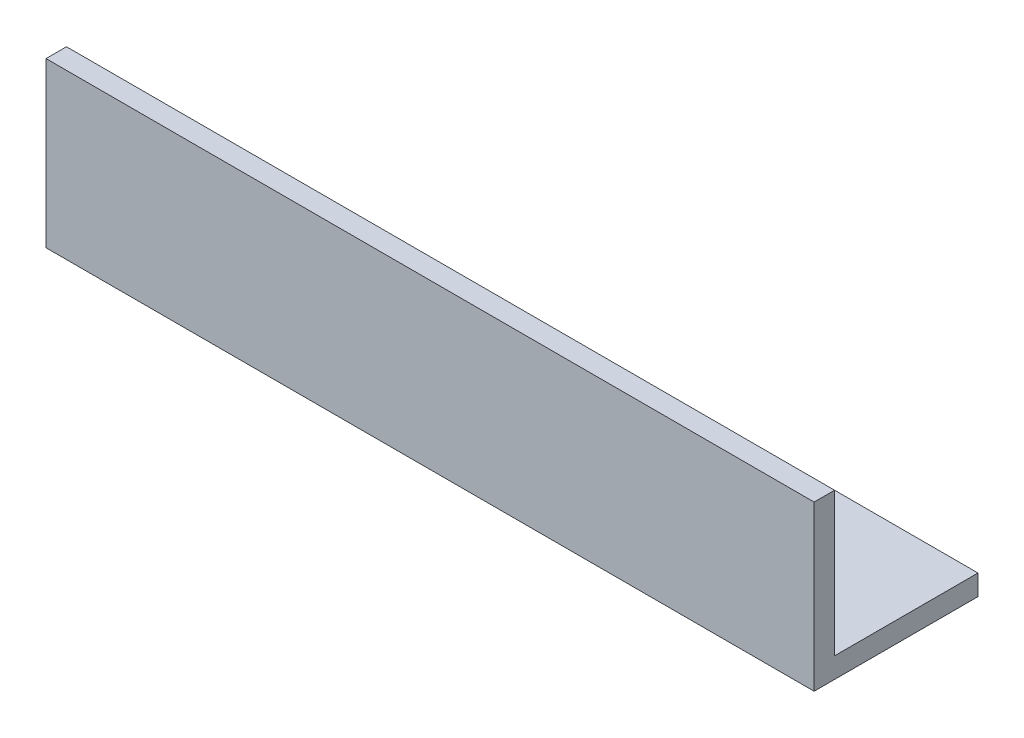
ISO-10303-21;
HEADER;
FILE_DESCRIPTION(('STEP AP214'),'2;1');
FILE_NAME('part.step','',(''),(''),'','','');
FILE_SCHEMA(('AUTOMOTIVE_DESIGN { 1 0 10303 214 1 1 1 1 }'));
ENDSEC;
DATA;
#1=APPLICATION_CONTEXT('core data for automotive mechanical design processes');
#2=APPLICATION_PROTOCOL_DEFINITION('international standard','automotive_design',2000,#1);
#3=PRODUCT_CONTEXT('',#1,'mechanical');
#4=PRODUCT('Part','Part','',(#3));
#5=PRODUCT_RELATED_PRODUCT_CATEGORY('part','',(#4));
#6=PRODUCT_DEFINITION_FORMATION('','',#4);
#7=PRODUCT_DEFINITION_CONTEXT('part definition',#1,'design');
#8=PRODUCT_DEFINITION('design','',#6,#7);
#9=PRODUCT_DEFINITION_SHAPE('','',#8);
#10=(LENGTH_UNIT() NAMED_UNIT(*) SI_UNIT(.MILLI.,.METRE.));
#11=(NAMED_UNIT(*) PLANE_ANGLE_UNIT() SI_UNIT($,.RADIAN.));
#12=(NAMED_UNIT(*) SI_UNIT($,.STERADIAN.) SOLID_ANGLE_UNIT());
#13=UNCERTAINTY_MEASURE_WITH_UNIT(LENGTH_MEASURE(1.E-05),#10,'distance_accuracy_value','');
#14=(GEOMETRIC_REPRESENTATION_CONTEXT(3) GLOBAL_UNCERTAINTY_ASSIGNED_CONTEXT((#13)) GLOBAL_UNIT_ASSIGNED_CONTEXT((#10,
#11,#12)) REPRESENTATION_CONTEXT('',''));
#15=CARTESIAN_POINT('',(0.,0.,0.));
#16=DIRECTION('',(0.,0.,1.));
#17=DIRECTION('',(1.,0.,0.));
#18=AXIS2_PLACEMENT_3D('',#15,#16,#17);
#19=CARTESIAN_POINT('',(150.,0.,0.));
#20=DIRECTION('',(0.,1.,0.));
#21=DIRECTION('',(0.,0.,1.));
#22=AXIS2_PLACEMENT_3D('',#19,#20,#21);
#23=PLANE('',#22);
#24=CARTESIAN_POINT('',(19.9999999999977,0.,-12.9999999999998));
#25=DIRECTION('',(0.,-1.,0.));
#26=DIRECTION('',(0.,0.,1.));
#27=AXIS2_PLACEMENT_3D('',#24,#25,#26);
#28=CIRCLE('',#27,4.99999999999999);
#29=CARTESIAN_POINT('',(19.9999999999977,0.,-7.9999999999998));
#30=VERTEX_POINT('',#29);
#31=EDGE_CURVE('E153',#30,#30,#28,.T.);
#32=ORIENTED_EDGE('',*,*,#31,.F.);
#33=EDGE_LOOP('',(#32));
#34=FACE_BOUND('',#33,.T.);
#35=CARTESIAN_POINT('',(49.9999999999977,0.,-13.));
#36=DIRECTION('',(0.,-1.,0.));
#37=DIRECTION('',(0.,0.,1.));
#38=AXIS2_PLACEMENT_3D('',#35,#36,#37);
#39=CIRCLE('',#38,4.99999999999999);
#40=CARTESIAN_POINT('',(49.9999999999977,0.,-8.00000000000001));
#41=VERTEX_POINT('',#40);
#42=EDGE_CURVE('E143',#41,#41,#39,.T.);
#43=ORIENTED_EDGE('',*,*,#42,.F.);
#44=EDGE_LOOP('',(#43));
#45=FACE_BOUND('',#44,.T.);
#46=CARTESIAN_POINT('',(100.,0.,-13.));
#47=DIRECTION('',(0.,-1.,0.));
#48=DIRECTION('',(0.,0.,-1.));
#49=AXIS2_PLACEMENT_3D('',#46,#47,#48);
#50=CIRCLE('',#49,4.99999999999999);
#51=CARTESIAN_POINT('',(100.,0.,-18.));
#52=VERTEX_POINT('',#51);
#53=EDGE_CURVE('E140',#52,#52,#50,.T.);
#54=ORIENTED_EDGE('',*,*,#53,.F.);
#55=EDGE_LOOP('',(#54));
#56=FACE_BOUND('',#55,.T.);
#57=CARTESIAN_POINT('',(130.,0.,-12.9999999999998));
#58=DIRECTION('',(0.,-1.,0.));
#59=DIRECTION('',(0.,0.,-1.));
#60=AXIS2_PLACEMENT_3D('',#57,#58,#59);
#61=CIRCLE('',#60,4.99999999999999);
#62=CARTESIAN_POINT('',(130.,0.,-17.9999999999998));
#63=VERTEX_POINT('',#62);
#64=EDGE_CURVE('E137',#63,#63,#61,.T.);
#65=ORIENTED_EDGE('',*,*,#64,.F.);
#66=EDGE_LOOP('',(#65));
#67=FACE_BOUND('',#66,.T.);
#68=DIRECTION('',(0.,0.,-1.));
#69=VECTOR('',#68,1.);
#70=CARTESIAN_POINT('',(0.,0.,0.));
#71=LINE('',#70,#69);
#72=CARTESIAN_POINT('',(0.,0.,0.));
#73=VERTEX_POINT('',#72);
#74=CARTESIAN_POINT('',(0.,0.,-32.));
#75=VERTEX_POINT('',#74);
#76=EDGE_CURVE('E117',#73,#75,#71,.T.);
#77=ORIENTED_EDGE('',*,*,#76,.T.);
#78=DIRECTION('',(-1.,0.,0.));
#79=VECTOR('',#78,1.);
#80=CARTESIAN_POINT('',(150.,0.,-32.));
#81=LINE('',#80,#79);
#82=CARTESIAN_POINT('',(150.,0.,-32.));
#83=VERTEX_POINT('',#82);
#84=EDGE_CURVE('E11',#83,#75,#81,.T.);
#85=ORIENTED_EDGE('',*,*,#84,.F.);
#86=DIRECTION('',(0.,0.,-1.));
#87=VECTOR('',#86,1.);
#88=CARTESIAN_POINT('',(150.,0.,0.));
#89=LINE('',#88,#87);
#90=CARTESIAN_POINT('',(150.,0.,0.));
#91=VERTEX_POINT('',#90);
#92=EDGE_CURVE('E82',#91,#83,#89,.T.);
#93=ORIENTED_EDGE('',*,*,#92,.F.);
#94=DIRECTION('',(-1.,0.,0.));
#95=VECTOR('',#94,1.);
#96=CARTESIAN_POINT('',(150.,0.,0.));
#97=LINE('',#96,#95);
#98=EDGE_CURVE('E113',#91,#73,#97,.T.);
#99=ORIENTED_EDGE('',*,*,#98,.T.);
#100=EDGE_LOOP('',(#77,#85,#93,#99));
#101=FACE_BOUND('',#100,.T.);
#102=ADVANCED_FACE('F34',(#34,#45,#56,#67,#101),#23,.F.);
#103=CARTESIAN_POINT('',(150.,4.,-32.));
#104=DIRECTION('',(0.,0.,-1.));
#105=DIRECTION('',(-1.,0.,0.));
#106=AXIS2_PLACEMENT_3D('',#103,#104,#105);
#107=PLANE('',#106);
#108=DIRECTION('',(0.,-1.,0.));
#109=VECTOR('',#108,1.);
#110=CARTESIAN_POINT('',(0.,4.,-32.));
#111=LINE('',#110,#109);
#112=CARTESIAN_POINT('',(0.,4.,-32.));
#113=VERTEX_POINT('',#112);
#114=EDGE_CURVE('E120',#113,#75,#111,.T.);
#115=ORIENTED_EDGE('',*,*,#114,.F.);
#116=DIRECTION('',(-1.,0.,0.));
#117=VECTOR('',#116,1.);
#118=CARTESIAN_POINT('',(150.,4.,-32.));
#119=LINE('',#118,#117);
#120=CARTESIAN_POINT('',(150.,4.,-32.));
#121=VERTEX_POINT('',#120);
#122=EDGE_CURVE('E43',#121,#113,#119,.T.);
#123=ORIENTED_EDGE('',*,*,#122,.F.);
#124=DIRECTION('',(0.,-1.,0.));
#125=VECTOR('',#124,1.);
#126=CARTESIAN_POINT('',(150.,4.,-32.));
#127=LINE('',#126,#125);
#128=EDGE_CURVE('E159',#121,#83,#127,.T.);
#129=ORIENTED_EDGE('',*,*,#128,.T.);
#130=ORIENTED_EDGE('',*,*,#84,.T.);
#131=EDGE_LOOP('',(#115,#123,#129,#130));
#132=FACE_BOUND('',#131,.T.);
#133=ADVANCED_FACE('F180',(#132),#107,.T.);
#134=CARTESIAN_POINT('',(150.,4.,0.));
#135=DIRECTION('',(0.,1.,0.));
#136=DIRECTION('',(0.,0.,1.));
#137=AXIS2_PLACEMENT_3D('',#134,#135,#136);
#138=PLANE('',#137);
#139=CARTESIAN_POINT('',(19.9999999999977,4.,-12.9999999999998));
#140=DIRECTION('',(0.,1.,0.));
#141=DIRECTION('',(0.,0.,1.));
#142=AXIS2_PLACEMENT_3D('',#139,#140,#141);
#143=CIRCLE('',#142,4.99999999999999);
#144=CARTESIAN_POINT('',(19.9999999999977,4.,-7.9999999999998));
#145=VERTEX_POINT('',#144);
#146=EDGE_CURVE('E37',#145,#145,#143,.T.);
#147=ORIENTED_EDGE('',*,*,#146,.F.);
#148=EDGE_LOOP('',(#147));
#149=FACE_BOUND('',#148,.T.);
#150=CARTESIAN_POINT('',(49.9999999999977,4.,-13.));
#151=DIRECTION('',(0.,1.,0.));
#152=DIRECTION('',(0.,0.,1.));
#153=AXIS2_PLACEMENT_3D('',#150,#151,#152);
#154=CIRCLE('',#153,4.99999999999999);
#155=CARTESIAN_POINT('',(49.9999999999977,4.,-8.00000000000001));
#156=VERTEX_POINT('',#155);
#157=EDGE_CURVE('E141',#156,#156,#154,.T.);
#158=ORIENTED_EDGE('',*,*,#157,.F.);
#159=EDGE_LOOP('',(#158));
#160=FACE_BOUND('',#159,.T.);
#161=CARTESIAN_POINT('',(100.,4.,-13.));
#162=DIRECTION('',(0.,1.,0.));
#163=DIRECTION('',(0.,0.,1.));
#164=AXIS2_PLACEMENT_3D('',#161,#162,#163);
#165=CIRCLE('',#164,4.99999999999999);
#166=CARTESIAN_POINT('',(100.,4.,-8.00000000000001));
#167=VERTEX_POINT('',#166);
#168=EDGE_CURVE('E138',#167,#167,#165,.T.);
#169=ORIENTED_EDGE('',*,*,#168,.F.);
#170=EDGE_LOOP('',(#169));
#171=FACE_BOUND('',#170,.T.);
#172=CARTESIAN_POINT('',(130.,4.,-12.9999999999998));
#173=DIRECTION('',(0.,1.,0.));
#174=DIRECTION('',(0.,0.,1.));
#175=AXIS2_PLACEMENT_3D('',#172,#173,#174);
#176=CIRCLE('',#175,4.99999999999999);
#177=CARTESIAN_POINT('',(130.,4.,-7.9999999999998));
#178=VERTEX_POINT('',#177);
#179=EDGE_CURVE('E121',#178,#178,#176,.T.);
#180=ORIENTED_EDGE('',*,*,#179,.F.);
#181=EDGE_LOOP('',(#180));
#182=FACE_BOUND('',#181,.T.);
#183=DIRECTION('',(0.,0.,-1.));
#184=VECTOR('',#183,1.);
#185=CARTESIAN_POINT('',(0.,4.,0.));
#186=LINE('',#185,#184);
#187=CARTESIAN_POINT('',(0.,4.,-4.));
#188=VERTEX_POINT('',#187);
#189=EDGE_CURVE('E124',#188,#113,#186,.T.);
#190=ORIENTED_EDGE('',*,*,#189,.F.);
#191=DIRECTION('',(-1.,0.,0.));
#192=VECTOR('',#191,1.);
#193=CARTESIAN_POINT('',(150.,4.,-4.));
#194=LINE('',#193,#192);
#195=CARTESIAN_POINT('',(150.,4.,-4.));
#196=VERTEX_POINT('',#195);
#197=EDGE_CURVE('E103',#196,#188,#194,.T.);
#198=ORIENTED_EDGE('',*,*,#197,.F.);
#199=DIRECTION('',(0.,0.,-1.));
#200=VECTOR('',#199,1.);
#201=CARTESIAN_POINT('',(150.,4.,0.));
#202=LINE('',#201,#200);
#203=EDGE_CURVE('E109',#196,#121,#202,.T.);
#204=ORIENTED_EDGE('',*,*,#203,.T.);
#205=ORIENTED_EDGE('',*,*,#122,.T.);
#206=EDGE_LOOP('',(#190,#198,#204,#205));
#207=FACE_BOUND('',#206,.T.);
#208=ADVANCED_FACE('F163',(#149,#160,#171,#182,#207),#138,.T.);
#209=CARTESIAN_POINT('',(150.,0.,-4.));
#210=DIRECTION('',(0.,0.,-1.));
#211=DIRECTION('',(-1.,0.,0.));
#212=AXIS2_PLACEMENT_3D('',#209,#210,#211);
#213=PLANE('',#212);
#214=DIRECTION('',(0.,1.,0.));
#215=VECTOR('',#214,1.);
#216=CARTESIAN_POINT('',(0.,0.,-4.));
#217=LINE('',#216,#215);
#218=CARTESIAN_POINT('',(0.,32.,-4.));
#219=VERTEX_POINT('',#218);
#220=EDGE_CURVE('E98',#219,#188,#217,.F.);
#221=ORIENTED_EDGE('',*,*,#220,.F.);
#222=DIRECTION('',(-1.,0.,0.));
#223=VECTOR('',#222,1.);
#224=CARTESIAN_POINT('',(150.,32.,-4.));
#225=LINE('',#224,#223);
#226=CARTESIAN_POINT('',(150.,32.,-4.));
#227=VERTEX_POINT('',#226);
#228=EDGE_CURVE('E93',#227,#219,#225,.T.);
#229=ORIENTED_EDGE('',*,*,#228,.F.);
#230=DIRECTION('',(0.,1.,0.));
#231=VECTOR('',#230,1.);
#232=CARTESIAN_POINT('',(150.,0.,-4.));
#233=LINE('',#232,#231);
#234=EDGE_CURVE('E96',#227,#196,#233,.F.);
#235=ORIENTED_EDGE('',*,*,#234,.T.);
#236=ORIENTED_EDGE('',*,*,#197,.T.);
#237=EDGE_LOOP('',(#221,#229,#235,#236));
#238=FACE_BOUND('',#237,.T.);
#239=ADVANCED_FACE('F95',(#238),#213,.T.);
#240=CARTESIAN_POINT('',(150.,32.,0.));
#241=DIRECTION('',(0.,1.,0.));
#242=DIRECTION('',(0.,0.,1.));
#243=AXIS2_PLACEMENT_3D('',#240,#241,#242);
#244=PLANE('',#243);
#245=DIRECTION('',(0.,0.,-1.));
#246=VECTOR('',#245,1.);
#247=CARTESIAN_POINT('',(0.,32.,0.));
#248=LINE('',#247,#246);
#249=CARTESIAN_POINT('',(0.,32.,0.));
#250=VERTEX_POINT('',#249);
#251=EDGE_CURVE('E128',#250,#219,#248,.T.);
#252=ORIENTED_EDGE('',*,*,#251,.F.);
#253=DIRECTION('',(-1.,0.,0.));
#254=VECTOR('',#253,1.);
#255=CARTESIAN_POINT('',(150.,32.,0.));
#256=LINE('',#255,#254);
#257=CARTESIAN_POINT('',(150.,32.,0.));
#258=VERTEX_POINT('',#257);
#259=EDGE_CURVE('E73',#258,#250,#256,.T.);
#260=ORIENTED_EDGE('',*,*,#259,.F.);
#261=DIRECTION('',(0.,0.,-1.));
#262=VECTOR('',#261,1.);
#263=CARTESIAN_POINT('',(150.,32.,0.));
#264=LINE('',#263,#262);
#265=EDGE_CURVE('E107',#258,#227,#264,.T.);
#266=ORIENTED_EDGE('',*,*,#265,.T.);
#267=ORIENTED_EDGE('',*,*,#228,.T.);
#268=EDGE_LOOP('',(#252,#260,#266,#267));
#269=FACE_BOUND('',#268,.T.);
#270=ADVANCED_FACE('F111',(#269),#244,.T.);
#271=CARTESIAN_POINT('',(150.,0.,0.));
#272=DIRECTION('',(0.,0.,-1.));
#273=DIRECTION('',(-1.,0.,0.));
#274=AXIS2_PLACEMENT_3D('',#271,#272,#273);
#275=PLANE('',#274);
#276=DIRECTION('',(0.,-1.,0.));
#277=VECTOR('',#276,1.);
#278=CARTESIAN_POINT('',(0.,0.,0.));
#279=LINE('',#278,#277);
#280=EDGE_CURVE('E76',#250,#73,#279,.T.);
#281=ORIENTED_EDGE('',*,*,#280,.T.);
#282=ORIENTED_EDGE('',*,*,#98,.F.);
#283=DIRECTION('',(0.,-1.,0.));
#284=VECTOR('',#283,1.);
#285=CARTESIAN_POINT('',(150.,0.,0.));
#286=LINE('',#285,#284);
#287=EDGE_CURVE('E52',#258,#91,#286,.T.);
#288=ORIENTED_EDGE('',*,*,#287,.F.);
#289=ORIENTED_EDGE('',*,*,#259,.T.);
#290=EDGE_LOOP('',(#281,#282,#288,#289));
#291=FACE_BOUND('',#290,.T.);
#292=ADVANCED_FACE('F169',(#291),#275,.F.);
#293=CARTESIAN_POINT('',(150.,0.,0.));
#294=DIRECTION('',(-1.,0.,0.));
#295=DIRECTION('',(0.,0.,1.));
#296=AXIS2_PLACEMENT_3D('',#293,#294,#295);
#297=PLANE('',#296);
#298=ORIENTED_EDGE('',*,*,#92,.T.);
#299=ORIENTED_EDGE('',*,*,#128,.F.);
#300=ORIENTED_EDGE('',*,*,#203,.F.);
#301=ORIENTED_EDGE('',*,*,#234,.F.);
#302=ORIENTED_EDGE('',*,*,#265,.F.);
#303=ORIENTED_EDGE('',*,*,#287,.T.);
#304=EDGE_LOOP('',(#298,#299,#300,#301,#302,#303));
#305=FACE_BOUND('',#304,.T.);
#306=ADVANCED_FACE('F106',(#305),#297,.F.);
#307=CARTESIAN_POINT('',(0.,0.,0.));
#308=DIRECTION('',(-1.,0.,0.));
#309=DIRECTION('',(0.,0.,1.));
#310=AXIS2_PLACEMENT_3D('',#307,#308,#309);
#311=PLANE('',#310);
#312=ORIENTED_EDGE('',*,*,#76,.F.);
#313=ORIENTED_EDGE('',*,*,#280,.F.);
#314=ORIENTED_EDGE('',*,*,#251,.T.);
#315=ORIENTED_EDGE('',*,*,#220,.T.);
#316=ORIENTED_EDGE('',*,*,#189,.T.);
#317=ORIENTED_EDGE('',*,*,#114,.T.);
#318=EDGE_LOOP('',(#312,#313,#314,#315,#316,#317));
#319=FACE_BOUND('',#318,.T.);
#320=ADVANCED_FACE('F167',(#319),#311,.T.);
#321=CARTESIAN_POINT('',(130.,32.,-12.9999999999998));
#322=DIRECTION('',(0.,-1.,0.));
#323=DIRECTION('',(0.,0.,-1.));
#324=AXIS2_PLACEMENT_3D('',#321,#322,#323);
#325=CYLINDRICAL_SURFACE('',#324,4.99999999999999);
#326=ORIENTED_EDGE('',*,*,#179,.T.);
#327=EDGE_LOOP('',(#326));
#328=FACE_BOUND('',#327,.T.);
#329=ORIENTED_EDGE('',*,*,#64,.T.);
#330=EDGE_LOOP('',(#329));
#331=FACE_BOUND('',#330,.T.);
#332=ADVANCED_FACE('F194',(#328,#331),#325,.F.);
#333=CARTESIAN_POINT('',(100.,32.,-13.));
#334=DIRECTION('',(0.,-1.,0.));
#335=DIRECTION('',(0.,0.,-1.));
#336=AXIS2_PLACEMENT_3D('',#333,#334,#335);
#337=CYLINDRICAL_SURFACE('',#336,4.99999999999999);
#338=ORIENTED_EDGE('',*,*,#168,.T.);
#339=EDGE_LOOP('',(#338));
#340=FACE_BOUND('',#339,.T.);
#341=ORIENTED_EDGE('',*,*,#53,.T.);
#342=EDGE_LOOP('',(#341));
#343=FACE_BOUND('',#342,.T.);
#344=ADVANCED_FACE('F196',(#340,#343),#337,.F.);
#345=CARTESIAN_POINT('',(49.9999999999977,32.,-13.));
#346=DIRECTION('',(0.,-1.,0.));
#347=DIRECTION('',(0.,0.,-1.));
#348=AXIS2_PLACEMENT_3D('',#345,#346,#347);
#349=CYLINDRICAL_SURFACE('',#348,4.99999999999999);
#350=ORIENTED_EDGE('',*,*,#157,.T.);
#351=EDGE_LOOP('',(#350));
#352=FACE_BOUND('',#351,.T.);
#353=ORIENTED_EDGE('',*,*,#42,.T.);
#354=EDGE_LOOP('',(#353));
#355=FACE_BOUND('',#354,.T.);
#356=ADVANCED_FACE('F203',(#352,#355),#349,.F.);
#357=CARTESIAN_POINT('',(19.9999999999977,32.,-12.9999999999998));
#358=DIRECTION('',(0.,-1.,0.));
#359=DIRECTION('',(0.,0.,-1.));
#360=AXIS2_PLACEMENT_3D('',#357,#358,#359);
#361=CYLINDRICAL_SURFACE('',#360,4.99999999999999);
#362=ORIENTED_EDGE('',*,*,#146,.T.);
#363=EDGE_LOOP('',(#362));
#364=FACE_BOUND('',#363,.T.);
#365=ORIENTED_EDGE('',*,*,#31,.T.);
#366=EDGE_LOOP('',(#365));
#367=FACE_BOUND('',#366,.T.);
#368=ADVANCED_FACE('F209',(#364,#367),#361,.F.);
#369=CLOSED_SHELL('',(#102,#133,#208,#239,#270,#292,#306,#320,#332,#344,#356,#368));
#370=MANIFOLD_SOLID_BREP('B2',#369);
#371=ADVANCED_BREP_SHAPE_REPRESENTATION('',(#18,#370),#14);
#372=SHAPE_DEFINITION_REPRESENTATION(#9,#371);
ENDSEC;
END-ISO-10303-21;
